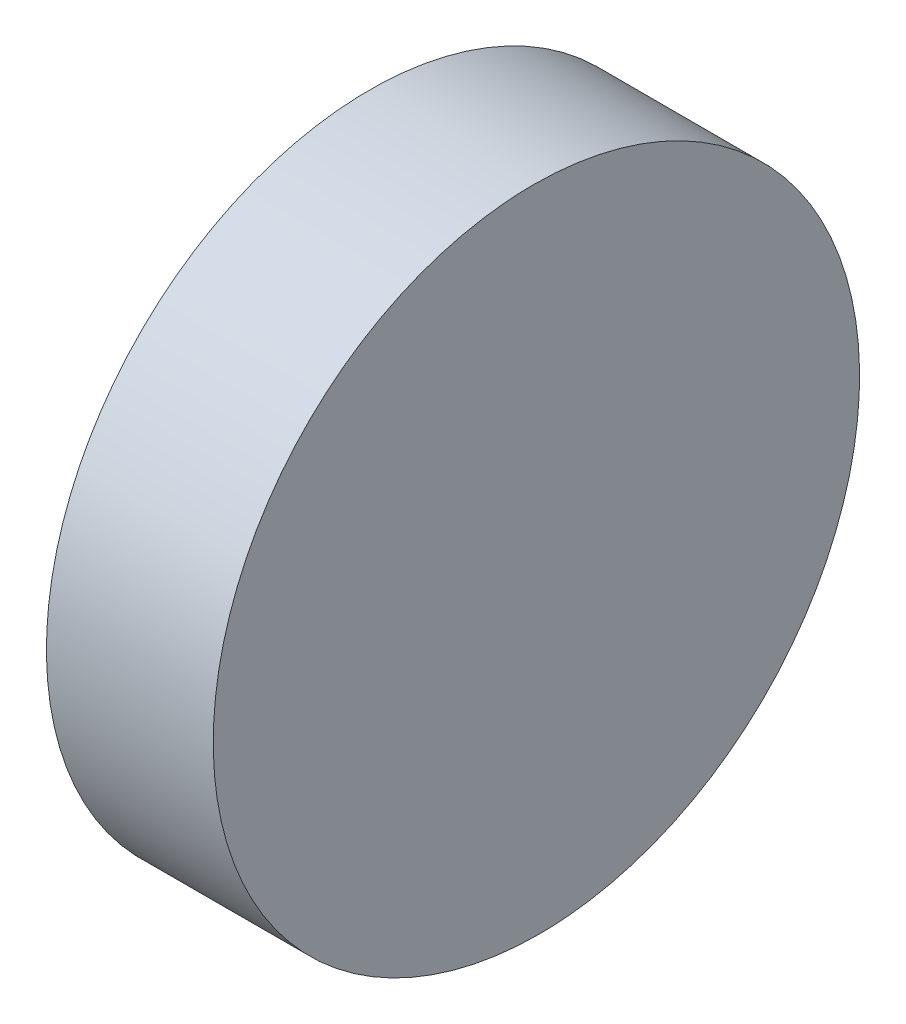
ISO-10303-21;
HEADER;
FILE_DESCRIPTION(('STEP AP214'),'2;1');
FILE_NAME('part.step','',(''),(''),'','','');
FILE_SCHEMA(('AUTOMOTIVE_DESIGN { 1 0 10303 214 1 1 1 1 }'));
ENDSEC;
DATA;
#1=APPLICATION_CONTEXT('core data for automotive mechanical design processes');
#2=APPLICATION_PROTOCOL_DEFINITION('international standard','automotive_design',2000,#1);
#3=PRODUCT_CONTEXT('',#1,'mechanical');
#4=PRODUCT('Part','Part','',(#3));
#5=PRODUCT_RELATED_PRODUCT_CATEGORY('part','',(#4));
#6=PRODUCT_DEFINITION_FORMATION('','',#4);
#7=PRODUCT_DEFINITION_CONTEXT('part definition',#1,'design');
#8=PRODUCT_DEFINITION('design','',#6,#7);
#9=PRODUCT_DEFINITION_SHAPE('','',#8);
#10=(LENGTH_UNIT() NAMED_UNIT(*) SI_UNIT(.MILLI.,.METRE.));
#11=(NAMED_UNIT(*) PLANE_ANGLE_UNIT() SI_UNIT($,.RADIAN.));
#12=(NAMED_UNIT(*) SI_UNIT($,.STERADIAN.) SOLID_ANGLE_UNIT());
#13=UNCERTAINTY_MEASURE_WITH_UNIT(LENGTH_MEASURE(1.E-05),#10,'distance_accuracy_value','');
#14=(GEOMETRIC_REPRESENTATION_CONTEXT(3) GLOBAL_UNCERTAINTY_ASSIGNED_CONTEXT((#13)) GLOBAL_UNIT_ASSIGNED_CONTEXT((#10,
#11,#12)) REPRESENTATION_CONTEXT('',''));
#15=CARTESIAN_POINT('',(0.,0.,0.));
#16=DIRECTION('',(0.,0.,1.));
#17=DIRECTION('',(1.,0.,0.));
#18=AXIS2_PLACEMENT_3D('',#15,#16,#17);
#19=CARTESIAN_POINT('',(0.,19.05,38.1));
#20=DIRECTION('',(1.,0.,0.));
#21=DIRECTION('',(0.,1.,0.));
#22=AXIS2_PLACEMENT_3D('',#19,#20,#21);
#23=PLANE('',#22);
#24=CARTESIAN_POINT('',(0.,0.,19.05));
#25=DIRECTION('',(-1.,0.,0.));
#26=DIRECTION('',(0.,-1.,0.));
#27=AXIS2_PLACEMENT_3D('',#24,#25,#26);
#28=CIRCLE('',#27,19.05);
#29=CARTESIAN_POINT('',(0.,-19.05,19.05));
#30=VERTEX_POINT('',#29);
#31=EDGE_CURVE('E76',#30,#30,#28,.T.);
#32=ORIENTED_EDGE('',*,*,#31,.T.);
#33=EDGE_LOOP('',(#32));
#34=FACE_BOUND('',#33,.T.);
#35=ADVANCED_FACE('F69',(#34),#23,.F.);
#36=CARTESIAN_POINT('',(10.,-19.05,38.1));
#37=DIRECTION('',(-0.999961923064171,-0.00872653549836698,0.));
#38=DIRECTION('',(0.00872653549836698,-0.999961923064172,0.));
#39=AXIS2_PLACEMENT_3D('',#36,#37,#38);
#40=PLANE('',#39);
#41=CARTESIAN_POINT('',(9.83375316858618,0.,19.05));
#42=DIRECTION('',(-0.999961923064171,-0.00872653549836698,0.));
#43=DIRECTION('',(-0.00872653549836698,0.999961923064172,0.));
#44=AXIS2_PLACEMENT_3D('',#41,#42,#43);
#45=ELLIPSE('',#44,19.0507253932483,19.05);
#46=CARTESIAN_POINT('',(9.66750633717236,19.05,19.05));
#47=VERTEX_POINT('',#46);
#48=EDGE_CURVE('E11',#47,#47,#45,.T.);
#49=ORIENTED_EDGE('',*,*,#48,.F.);
#50=EDGE_LOOP('',(#49));
#51=FACE_BOUND('',#50,.T.);
#52=ADVANCED_FACE('F71',(#51),#40,.F.);
#53=CARTESIAN_POINT('',(10.,0.,19.05));
#54=DIRECTION('',(-1.,0.,0.));
#55=DIRECTION('',(0.,-1.,0.));
#56=AXIS2_PLACEMENT_3D('',#53,#54,#55);
#57=CYLINDRICAL_SURFACE('',#56,19.05);
#58=ORIENTED_EDGE('',*,*,#31,.F.);
#59=EDGE_LOOP('',(#58));
#60=FACE_BOUND('',#59,.T.);
#61=ORIENTED_EDGE('',*,*,#48,.T.);
#62=EDGE_LOOP('',(#61));
#63=FACE_BOUND('',#62,.T.);
#64=ADVANCED_FACE('F83',(#60,#63),#57,.T.);
#65=CLOSED_SHELL('',(#35,#52,#64));
#66=MANIFOLD_SOLID_BREP('B2',#65);
#67=ADVANCED_BREP_SHAPE_REPRESENTATION('',(#18,#66),#14);
#68=SHAPE_DEFINITION_REPRESENTATION(#9,#67);
ENDSEC;
END-ISO-10303-21;
